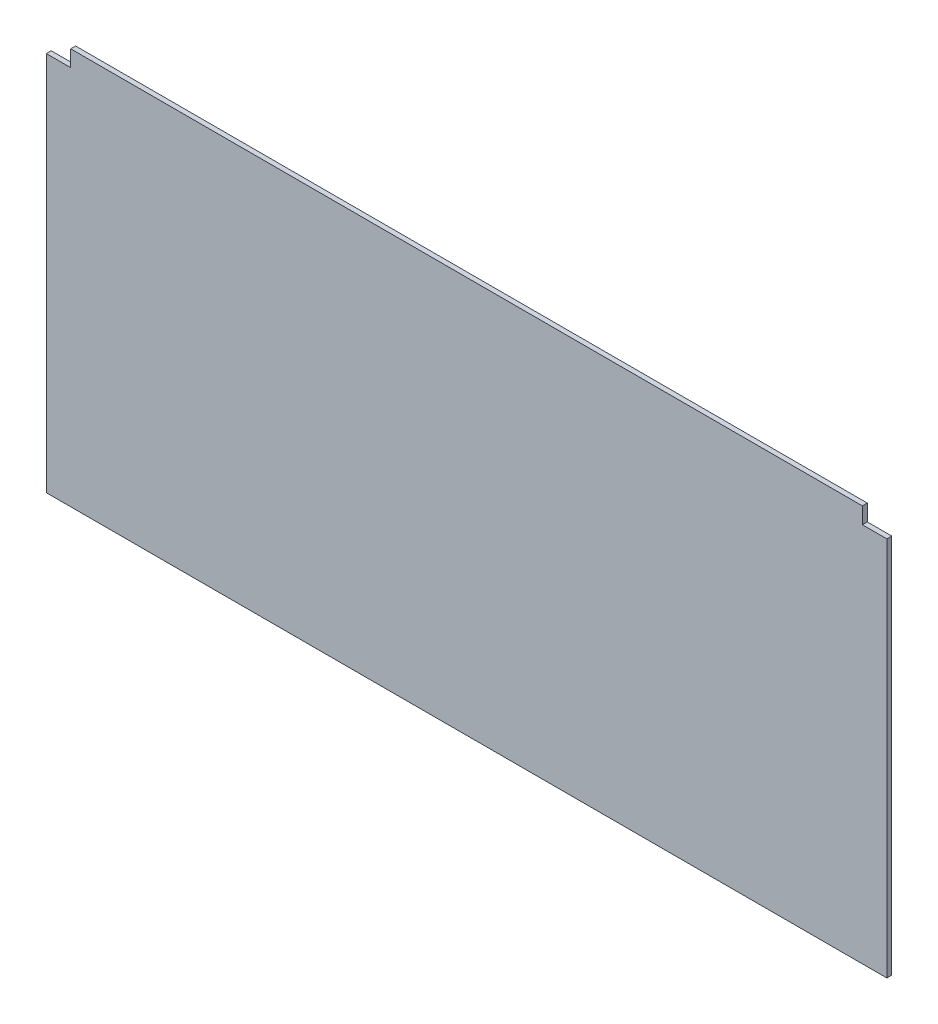
ISO-10303-21;
HEADER;
FILE_DESCRIPTION(('STEP AP214'),'2;1');
FILE_NAME('part.step','',(''),(''),'','','');
FILE_SCHEMA(('AUTOMOTIVE_DESIGN { 1 0 10303 214 1 1 1 1 }'));
ENDSEC;
DATA;
#1=APPLICATION_CONTEXT('core data for automotive mechanical design processes');
#2=APPLICATION_PROTOCOL_DEFINITION('international standard','automotive_design',2000,#1);
#3=PRODUCT_CONTEXT('',#1,'mechanical');
#4=PRODUCT('Part','Part','',(#3));
#5=PRODUCT_RELATED_PRODUCT_CATEGORY('part','',(#4));
#6=PRODUCT_DEFINITION_FORMATION('','',#4);
#7=PRODUCT_DEFINITION_CONTEXT('part definition',#1,'design');
#8=PRODUCT_DEFINITION('design','',#6,#7);
#9=PRODUCT_DEFINITION_SHAPE('','',#8);
#10=(LENGTH_UNIT() NAMED_UNIT(*) SI_UNIT(.MILLI.,.METRE.));
#11=(NAMED_UNIT(*) PLANE_ANGLE_UNIT() SI_UNIT($,.RADIAN.));
#12=(NAMED_UNIT(*) SI_UNIT($,.STERADIAN.) SOLID_ANGLE_UNIT());
#13=UNCERTAINTY_MEASURE_WITH_UNIT(LENGTH_MEASURE(1.E-05),#10,'distance_accuracy_value','');
#14=(GEOMETRIC_REPRESENTATION_CONTEXT(3) GLOBAL_UNCERTAINTY_ASSIGNED_CONTEXT((#13)) GLOBAL_UNIT_ASSIGNED_CONTEXT((#10,
#11,#12)) REPRESENTATION_CONTEXT('',''));
#15=CARTESIAN_POINT('',(0.,0.,0.));
#16=DIRECTION('',(0.,0.,1.));
#17=DIRECTION('',(1.,0.,0.));
#18=AXIS2_PLACEMENT_3D('',#15,#16,#17);
#19=CARTESIAN_POINT('',(-257.5,0.,-3.));
#20=DIRECTION('',(-1.,0.,0.));
#21=DIRECTION('',(0.,0.,1.));
#22=AXIS2_PLACEMENT_3D('',#19,#20,#21);
#23=PLANE('',#22);
#24=DIRECTION('',(0.,0.,1.));
#25=VECTOR('',#24,1.);
#26=CARTESIAN_POINT('',(-257.5,233.,-3.));
#27=LINE('',#26,#25);
#28=CARTESIAN_POINT('',(-257.5,233.,-3.));
#29=VERTEX_POINT('',#28);
#30=CARTESIAN_POINT('',(-257.5,233.,0.));
#31=VERTEX_POINT('',#30);
#32=EDGE_CURVE('E58',#29,#31,#27,.T.);
#33=ORIENTED_EDGE('',*,*,#32,.F.);
#34=DIRECTION('',(0.,-1.,0.));
#35=VECTOR('',#34,1.);
#36=CARTESIAN_POINT('',(-257.5,0.,-3.));
#37=LINE('',#36,#35);
#38=CARTESIAN_POINT('',(-257.5,0.,-3.));
#39=VERTEX_POINT('',#38);
#40=EDGE_CURVE('E112',#29,#39,#37,.T.);
#41=ORIENTED_EDGE('',*,*,#40,.T.);
#42=DIRECTION('',(0.,0.,1.));
#43=VECTOR('',#42,1.);
#44=CARTESIAN_POINT('',(-257.5,0.,-3.));
#45=LINE('',#44,#43);
#46=CARTESIAN_POINT('',(-257.5,0.,0.));
#47=VERTEX_POINT('',#46);
#48=EDGE_CURVE('E39',#39,#47,#45,.T.);
#49=ORIENTED_EDGE('',*,*,#48,.T.);
#50=DIRECTION('',(0.,-1.,0.));
#51=VECTOR('',#50,1.);
#52=CARTESIAN_POINT('',(-257.5,0.,0.));
#53=LINE('',#52,#51);
#54=EDGE_CURVE('E114',#31,#47,#53,.T.);
#55=ORIENTED_EDGE('',*,*,#54,.F.);
#56=EDGE_LOOP('',(#33,#41,#49,#55));
#57=FACE_BOUND('',#56,.T.);
#58=ADVANCED_FACE('F36',(#57),#23,.T.);
#59=CARTESIAN_POINT('',(-257.5,243.,-3.));
#60=DIRECTION('',(0.,1.,0.));
#61=DIRECTION('',(0.,0.,1.));
#62=AXIS2_PLACEMENT_3D('',#59,#60,#61);
#63=PLANE('',#62);
#64=DIRECTION('',(0.,0.,1.));
#65=VECTOR('',#64,1.);
#66=CARTESIAN_POINT('',(-242.5,243.,-3.));
#67=LINE('',#66,#65);
#68=CARTESIAN_POINT('',(-242.5,243.,-3.));
#69=VERTEX_POINT('',#68);
#70=CARTESIAN_POINT('',(-242.5,243.,0.));
#71=VERTEX_POINT('',#70);
#72=EDGE_CURVE('E138',#69,#71,#67,.T.);
#73=ORIENTED_EDGE('',*,*,#72,.T.);
#74=DIRECTION('',(-1.,0.,0.));
#75=VECTOR('',#74,1.);
#76=CARTESIAN_POINT('',(-257.5,243.,0.));
#77=LINE('',#76,#75);
#78=CARTESIAN_POINT('',(242.5,243.,0.));
#79=VERTEX_POINT('',#78);
#80=EDGE_CURVE('E121',#79,#71,#77,.T.);
#81=ORIENTED_EDGE('',*,*,#80,.F.);
#82=DIRECTION('',(0.,0.,1.));
#83=VECTOR('',#82,1.);
#84=CARTESIAN_POINT('',(242.5,243.,-3.));
#85=LINE('',#84,#83);
#86=CARTESIAN_POINT('',(242.5,243.,-3.));
#87=VERTEX_POINT('',#86);
#88=EDGE_CURVE('E50',#87,#79,#85,.T.);
#89=ORIENTED_EDGE('',*,*,#88,.F.);
#90=DIRECTION('',(-1.,0.,0.));
#91=VECTOR('',#90,1.);
#92=CARTESIAN_POINT('',(-257.5,243.,-3.));
#93=LINE('',#92,#91);
#94=EDGE_CURVE('E133',#87,#69,#93,.T.);
#95=ORIENTED_EDGE('',*,*,#94,.T.);
#96=EDGE_LOOP('',(#73,#81,#89,#95));
#97=FACE_BOUND('',#96,.T.);
#98=ADVANCED_FACE('F175',(#97),#63,.T.);
#99=CARTESIAN_POINT('',(257.5,0.,-3.));
#100=DIRECTION('',(1.,0.,0.));
#101=DIRECTION('',(0.,0.,-1.));
#102=AXIS2_PLACEMENT_3D('',#99,#100,#101);
#103=PLANE('',#102);
#104=DIRECTION('',(0.,0.,1.));
#105=VECTOR('',#104,1.);
#106=CARTESIAN_POINT('',(257.5,233.,-3.));
#107=LINE('',#106,#105);
#108=CARTESIAN_POINT('',(257.5,233.,-3.));
#109=VERTEX_POINT('',#108);
#110=CARTESIAN_POINT('',(257.5,233.,0.));
#111=VERTEX_POINT('',#110);
#112=EDGE_CURVE('E151',#109,#111,#107,.T.);
#113=ORIENTED_EDGE('',*,*,#112,.T.);
#114=DIRECTION('',(0.,1.,0.));
#115=VECTOR('',#114,1.);
#116=CARTESIAN_POINT('',(257.5,0.,0.));
#117=LINE('',#116,#115);
#118=CARTESIAN_POINT('',(257.5,0.,0.));
#119=VERTEX_POINT('',#118);
#120=EDGE_CURVE('E126',#119,#111,#117,.T.);
#121=ORIENTED_EDGE('',*,*,#120,.F.);
#122=DIRECTION('',(0.,0.,1.));
#123=VECTOR('',#122,1.);
#124=CARTESIAN_POINT('',(257.5,0.,-3.));
#125=LINE('',#124,#123);
#126=CARTESIAN_POINT('',(257.5,0.,-3.));
#127=VERTEX_POINT('',#126);
#128=EDGE_CURVE('E11',#127,#119,#125,.T.);
#129=ORIENTED_EDGE('',*,*,#128,.F.);
#130=DIRECTION('',(0.,1.,0.));
#131=VECTOR('',#130,1.);
#132=CARTESIAN_POINT('',(257.5,0.,-3.));
#133=LINE('',#132,#131);
#134=EDGE_CURVE('E123',#127,#109,#133,.T.);
#135=ORIENTED_EDGE('',*,*,#134,.T.);
#136=EDGE_LOOP('',(#113,#121,#129,#135));
#137=FACE_BOUND('',#136,.T.);
#138=ADVANCED_FACE('F150',(#137),#103,.T.);
#139=CARTESIAN_POINT('',(-257.5,0.,-3.));
#140=DIRECTION('',(0.,-1.,0.));
#141=DIRECTION('',(0.,0.,-1.));
#142=AXIS2_PLACEMENT_3D('',#139,#140,#141);
#143=PLANE('',#142);
#144=DIRECTION('',(1.,0.,0.));
#145=VECTOR('',#144,1.);
#146=CARTESIAN_POINT('',(-257.5,0.,0.));
#147=LINE('',#146,#145);
#148=EDGE_CURVE('E137',#47,#119,#147,.T.);
#149=ORIENTED_EDGE('',*,*,#148,.F.);
#150=ORIENTED_EDGE('',*,*,#48,.F.);
#151=DIRECTION('',(1.,0.,0.));
#152=VECTOR('',#151,1.);
#153=CARTESIAN_POINT('',(-257.5,0.,-3.));
#154=LINE('',#153,#152);
#155=EDGE_CURVE('E120',#39,#127,#154,.T.);
#156=ORIENTED_EDGE('',*,*,#155,.T.);
#157=ORIENTED_EDGE('',*,*,#128,.T.);
#158=EDGE_LOOP('',(#149,#150,#156,#157));
#159=FACE_BOUND('',#158,.T.);
#160=ADVANCED_FACE('F181',(#159),#143,.T.);
#161=CARTESIAN_POINT('',(0.,0.,-3.));
#162=DIRECTION('',(0.,0.,-1.));
#163=DIRECTION('',(-1.,0.,0.));
#164=AXIS2_PLACEMENT_3D('',#161,#162,#163);
#165=PLANE('',#164);
#166=DIRECTION('',(0.,1.,0.));
#167=VECTOR('',#166,1.);
#168=CARTESIAN_POINT('',(-242.5,243.,-3.));
#169=LINE('',#168,#167);
#170=CARTESIAN_POINT('',(-242.5,233.,-3.));
#171=VERTEX_POINT('',#170);
#172=EDGE_CURVE('E106',#171,#69,#169,.T.);
#173=ORIENTED_EDGE('',*,*,#172,.T.);
#174=ORIENTED_EDGE('',*,*,#94,.F.);
#175=DIRECTION('',(0.,-1.,0.));
#176=VECTOR('',#175,1.);
#177=CARTESIAN_POINT('',(242.5,243.,-3.));
#178=LINE('',#177,#176);
#179=CARTESIAN_POINT('',(242.5,233.,-3.));
#180=VERTEX_POINT('',#179);
#181=EDGE_CURVE('E161',#87,#180,#178,.T.);
#182=ORIENTED_EDGE('',*,*,#181,.T.);
#183=DIRECTION('',(1.,0.,0.));
#184=VECTOR('',#183,1.);
#185=CARTESIAN_POINT('',(257.5,233.,-3.));
#186=LINE('',#185,#184);
#187=EDGE_CURVE('E164',#180,#109,#186,.T.);
#188=ORIENTED_EDGE('',*,*,#187,.T.);
#189=ORIENTED_EDGE('',*,*,#134,.F.);
#190=ORIENTED_EDGE('',*,*,#155,.F.);
#191=ORIENTED_EDGE('',*,*,#40,.F.);
#192=DIRECTION('',(1.,0.,0.));
#193=VECTOR('',#192,1.);
#194=CARTESIAN_POINT('',(-257.5,233.,-3.));
#195=LINE('',#194,#193);
#196=EDGE_CURVE('E99',#29,#171,#195,.T.);
#197=ORIENTED_EDGE('',*,*,#196,.T.);
#198=EDGE_LOOP('',(#173,#174,#182,#188,#189,#190,#191,#197));
#199=FACE_BOUND('',#198,.T.);
#200=ADVANCED_FACE('F117',(#199),#165,.T.);
#201=CARTESIAN_POINT('',(0.,0.,0.));
#202=DIRECTION('',(0.,0.,-1.));
#203=DIRECTION('',(-1.,0.,0.));
#204=AXIS2_PLACEMENT_3D('',#201,#202,#203);
#205=PLANE('',#204);
#206=ORIENTED_EDGE('',*,*,#80,.T.);
#207=DIRECTION('',(0.,1.,0.));
#208=VECTOR('',#207,1.);
#209=CARTESIAN_POINT('',(-242.5,243.,0.));
#210=LINE('',#209,#208);
#211=CARTESIAN_POINT('',(-242.5,233.,0.));
#212=VERTEX_POINT('',#211);
#213=EDGE_CURVE('E107',#212,#71,#210,.T.);
#214=ORIENTED_EDGE('',*,*,#213,.F.);
#215=DIRECTION('',(1.,0.,0.));
#216=VECTOR('',#215,1.);
#217=CARTESIAN_POINT('',(-257.5,233.,0.));
#218=LINE('',#217,#216);
#219=EDGE_CURVE('E155',#31,#212,#218,.T.);
#220=ORIENTED_EDGE('',*,*,#219,.F.);
#221=ORIENTED_EDGE('',*,*,#54,.T.);
#222=ORIENTED_EDGE('',*,*,#148,.T.);
#223=ORIENTED_EDGE('',*,*,#120,.T.);
#224=DIRECTION('',(1.,0.,0.));
#225=VECTOR('',#224,1.);
#226=CARTESIAN_POINT('',(257.5,233.,0.));
#227=LINE('',#226,#225);
#228=CARTESIAN_POINT('',(242.5,233.,0.));
#229=VERTEX_POINT('',#228);
#230=EDGE_CURVE('E146',#229,#111,#227,.T.);
#231=ORIENTED_EDGE('',*,*,#230,.F.);
#232=DIRECTION('',(0.,-1.,0.));
#233=VECTOR('',#232,1.);
#234=CARTESIAN_POINT('',(242.5,243.,0.));
#235=LINE('',#234,#233);
#236=EDGE_CURVE('E162',#79,#229,#235,.T.);
#237=ORIENTED_EDGE('',*,*,#236,.F.);
#238=EDGE_LOOP('',(#206,#214,#220,#221,#222,#223,#231,#237));
#239=FACE_BOUND('',#238,.T.);
#240=ADVANCED_FACE('F145',(#239),#205,.F.);
#241=CARTESIAN_POINT('',(257.5,233.,-3.));
#242=DIRECTION('',(0.,-1.,0.));
#243=DIRECTION('',(0.,0.,-1.));
#244=AXIS2_PLACEMENT_3D('',#241,#242,#243);
#245=PLANE('',#244);
#246=ORIENTED_EDGE('',*,*,#230,.T.);
#247=ORIENTED_EDGE('',*,*,#112,.F.);
#248=ORIENTED_EDGE('',*,*,#187,.F.);
#249=DIRECTION('',(0.,0.,1.));
#250=VECTOR('',#249,1.);
#251=CARTESIAN_POINT('',(242.5,233.,-3.));
#252=LINE('',#251,#250);
#253=EDGE_CURVE('E156',#180,#229,#252,.T.);
#254=ORIENTED_EDGE('',*,*,#253,.T.);
#255=EDGE_LOOP('',(#246,#247,#248,#254));
#256=FACE_BOUND('',#255,.T.);
#257=ADVANCED_FACE('F179',(#256),#245,.F.);
#258=CARTESIAN_POINT('',(242.5,243.,-3.));
#259=DIRECTION('',(-1.,0.,0.));
#260=DIRECTION('',(0.,0.,1.));
#261=AXIS2_PLACEMENT_3D('',#258,#259,#260);
#262=PLANE('',#261);
#263=ORIENTED_EDGE('',*,*,#236,.T.);
#264=ORIENTED_EDGE('',*,*,#253,.F.);
#265=ORIENTED_EDGE('',*,*,#181,.F.);
#266=ORIENTED_EDGE('',*,*,#88,.T.);
#267=EDGE_LOOP('',(#263,#264,#265,#266));
#268=FACE_BOUND('',#267,.T.);
#269=ADVANCED_FACE('F178',(#268),#262,.F.);
#270=CARTESIAN_POINT('',(-242.5,243.,-3.));
#271=DIRECTION('',(1.,0.,0.));
#272=DIRECTION('',(0.,0.,-1.));
#273=AXIS2_PLACEMENT_3D('',#270,#271,#272);
#274=PLANE('',#273);
#275=ORIENTED_EDGE('',*,*,#213,.T.);
#276=ORIENTED_EDGE('',*,*,#72,.F.);
#277=ORIENTED_EDGE('',*,*,#172,.F.);
#278=DIRECTION('',(0.,0.,1.));
#279=VECTOR('',#278,1.);
#280=CARTESIAN_POINT('',(-242.5,233.,-3.));
#281=LINE('',#280,#279);
#282=EDGE_CURVE('E101',#171,#212,#281,.T.);
#283=ORIENTED_EDGE('',*,*,#282,.T.);
#284=EDGE_LOOP('',(#275,#276,#277,#283));
#285=FACE_BOUND('',#284,.T.);
#286=ADVANCED_FACE('F201',(#285),#274,.F.);
#287=CARTESIAN_POINT('',(-257.5,233.,-3.));
#288=DIRECTION('',(0.,-1.,0.));
#289=DIRECTION('',(0.,0.,-1.));
#290=AXIS2_PLACEMENT_3D('',#287,#288,#289);
#291=PLANE('',#290);
#292=ORIENTED_EDGE('',*,*,#219,.T.);
#293=ORIENTED_EDGE('',*,*,#282,.F.);
#294=ORIENTED_EDGE('',*,*,#196,.F.);
#295=ORIENTED_EDGE('',*,*,#32,.T.);
#296=EDGE_LOOP('',(#292,#293,#294,#295));
#297=FACE_BOUND('',#296,.T.);
#298=ADVANCED_FACE('F100',(#297),#291,.F.);
#299=CLOSED_SHELL('',(#58,#98,#138,#160,#200,#240,#257,#269,#286,#298));
#300=MANIFOLD_SOLID_BREP('B2',#299);
#301=ADVANCED_BREP_SHAPE_REPRESENTATION('',(#18,#300),#14);
#302=SHAPE_DEFINITION_REPRESENTATION(#9,#301);
ENDSEC;
END-ISO-10303-21;
